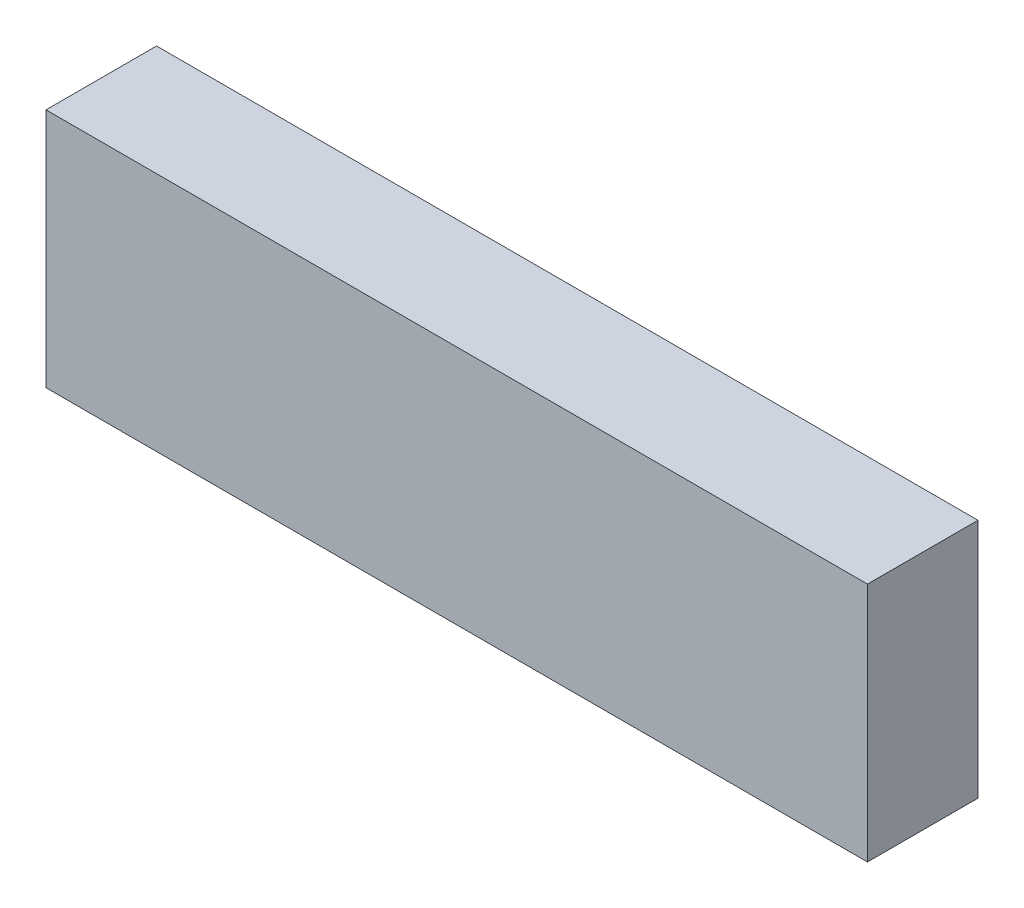
ISO-10303-21;
HEADER;
FILE_DESCRIPTION(('STEP AP214'),'2;1');
FILE_NAME('part.step','',(''),(''),'','','');
FILE_SCHEMA(('AUTOMOTIVE_DESIGN { 1 0 10303 214 1 1 1 1 }'));
ENDSEC;
DATA;
#1=APPLICATION_CONTEXT('core data for automotive mechanical design processes');
#2=APPLICATION_PROTOCOL_DEFINITION('international standard','automotive_design',2000,#1);
#3=PRODUCT_CONTEXT('',#1,'mechanical');
#4=PRODUCT('Part','Part','',(#3));
#5=PRODUCT_RELATED_PRODUCT_CATEGORY('part','',(#4));
#6=PRODUCT_DEFINITION_FORMATION('','',#4);
#7=PRODUCT_DEFINITION_CONTEXT('part definition',#1,'design');
#8=PRODUCT_DEFINITION('design','',#6,#7);
#9=PRODUCT_DEFINITION_SHAPE('','',#8);
#10=(LENGTH_UNIT() NAMED_UNIT(*) SI_UNIT(.MILLI.,.METRE.));
#11=(NAMED_UNIT(*) PLANE_ANGLE_UNIT() SI_UNIT($,.RADIAN.));
#12=(NAMED_UNIT(*) SI_UNIT($,.STERADIAN.) SOLID_ANGLE_UNIT());
#13=UNCERTAINTY_MEASURE_WITH_UNIT(LENGTH_MEASURE(1.E-05),#10,'distance_accuracy_value','');
#14=(GEOMETRIC_REPRESENTATION_CONTEXT(3) GLOBAL_UNCERTAINTY_ASSIGNED_CONTEXT((#13)) GLOBAL_UNIT_ASSIGNED_CONTEXT((#10,
#11,#12)) REPRESENTATION_CONTEXT('',''));
#15=CARTESIAN_POINT('',(0.,0.,0.));
#16=DIRECTION('',(0.,0.,1.));
#17=DIRECTION('',(1.,0.,0.));
#18=AXIS2_PLACEMENT_3D('',#15,#16,#17);
#19=CARTESIAN_POINT('',(29.58465,-8.66775,7.9629));
#20=DIRECTION('',(-1.,0.,0.));
#21=DIRECTION('',(0.,0.,1.));
#22=AXIS2_PLACEMENT_3D('',#19,#20,#21);
#23=PLANE('',#22);
#24=DIRECTION('',(0.,1.,0.));
#25=VECTOR('',#24,1.);
#26=CARTESIAN_POINT('',(29.58465,-8.66775,0.));
#27=LINE('',#26,#25);
#28=CARTESIAN_POINT('',(29.58465,-8.66775,0.));
#29=VERTEX_POINT('',#28);
#30=CARTESIAN_POINT('',(29.58465,8.66775,0.));
#31=VERTEX_POINT('',#30);
#32=EDGE_CURVE('E107',#29,#31,#27,.T.);
#33=ORIENTED_EDGE('',*,*,#32,.T.);
#34=DIRECTION('',(0.,0.,-1.));
#35=VECTOR('',#34,1.);
#36=CARTESIAN_POINT('',(29.58465,8.66775,7.9629));
#37=LINE('',#36,#35);
#38=CARTESIAN_POINT('',(29.58465,8.66775,7.9629));
#39=VERTEX_POINT('',#38);
#40=EDGE_CURVE('E11',#39,#31,#37,.T.);
#41=ORIENTED_EDGE('',*,*,#40,.F.);
#42=DIRECTION('',(0.,1.,0.));
#43=VECTOR('',#42,1.);
#44=CARTESIAN_POINT('',(29.58465,-8.66775,7.9629));
#45=LINE('',#44,#43);
#46=CARTESIAN_POINT('',(29.58465,-8.66775,7.9629));
#47=VERTEX_POINT('',#46);
#48=EDGE_CURVE('E91',#47,#39,#45,.T.);
#49=ORIENTED_EDGE('',*,*,#48,.F.);
#50=DIRECTION('',(0.,0.,-1.));
#51=VECTOR('',#50,1.);
#52=CARTESIAN_POINT('',(29.58465,-8.66775,7.9629));
#53=LINE('',#52,#51);
#54=EDGE_CURVE('E103',#47,#29,#53,.T.);
#55=ORIENTED_EDGE('',*,*,#54,.T.);
#56=EDGE_LOOP('',(#33,#41,#49,#55));
#57=FACE_BOUND('',#56,.T.);
#58=ADVANCED_FACE('F39',(#57),#23,.F.);
#59=CARTESIAN_POINT('',(-29.58465,8.66775,7.9629));
#60=DIRECTION('',(0.,-1.,0.));
#61=DIRECTION('',(0.,0.,-1.));
#62=AXIS2_PLACEMENT_3D('',#59,#60,#61);
#63=PLANE('',#62);
#64=DIRECTION('',(-1.,0.,0.));
#65=VECTOR('',#64,1.);
#66=CARTESIAN_POINT('',(-29.58465,8.66775,0.));
#67=LINE('',#66,#65);
#68=CARTESIAN_POINT('',(-29.58465,8.66775,0.));
#69=VERTEX_POINT('',#68);
#70=EDGE_CURVE('E96',#31,#69,#67,.T.);
#71=ORIENTED_EDGE('',*,*,#70,.T.);
#72=DIRECTION('',(0.,0.,-1.));
#73=VECTOR('',#72,1.);
#74=CARTESIAN_POINT('',(-29.58465,8.66775,7.9629));
#75=LINE('',#74,#73);
#76=CARTESIAN_POINT('',(-29.58465,8.66775,7.9629));
#77=VERTEX_POINT('',#76);
#78=EDGE_CURVE('E48',#77,#69,#75,.T.);
#79=ORIENTED_EDGE('',*,*,#78,.F.);
#80=DIRECTION('',(-1.,0.,0.));
#81=VECTOR('',#80,1.);
#82=CARTESIAN_POINT('',(-29.58465,8.66775,7.9629));
#83=LINE('',#82,#81);
#84=EDGE_CURVE('E86',#39,#77,#83,.T.);
#85=ORIENTED_EDGE('',*,*,#84,.F.);
#86=ORIENTED_EDGE('',*,*,#40,.T.);
#87=EDGE_LOOP('',(#71,#79,#85,#86));
#88=FACE_BOUND('',#87,.T.);
#89=ADVANCED_FACE('F95',(#88),#63,.F.);
#90=CARTESIAN_POINT('',(-29.58465,-8.66775,7.9629));
#91=DIRECTION('',(1.,0.,0.));
#92=DIRECTION('',(0.,0.,-1.));
#93=AXIS2_PLACEMENT_3D('',#90,#91,#92);
#94=PLANE('',#93);
#95=DIRECTION('',(0.,-1.,0.));
#96=VECTOR('',#95,1.);
#97=CARTESIAN_POINT('',(-29.58465,-8.66775,0.));
#98=LINE('',#97,#96);
#99=CARTESIAN_POINT('',(-29.58465,-8.66775,0.));
#100=VERTEX_POINT('',#99);
#101=EDGE_CURVE('E73',#69,#100,#98,.T.);
#102=ORIENTED_EDGE('',*,*,#101,.T.);
#103=DIRECTION('',(0.,0.,-1.));
#104=VECTOR('',#103,1.);
#105=CARTESIAN_POINT('',(-29.58465,-8.66775,7.9629));
#106=LINE('',#105,#104);
#107=CARTESIAN_POINT('',(-29.58465,-8.66775,7.9629));
#108=VERTEX_POINT('',#107);
#109=EDGE_CURVE('E98',#108,#100,#106,.T.);
#110=ORIENTED_EDGE('',*,*,#109,.F.);
#111=DIRECTION('',(0.,-1.,0.));
#112=VECTOR('',#111,1.);
#113=CARTESIAN_POINT('',(-29.58465,-8.66775,7.9629));
#114=LINE('',#113,#112);
#115=EDGE_CURVE('E89',#77,#108,#114,.T.);
#116=ORIENTED_EDGE('',*,*,#115,.F.);
#117=ORIENTED_EDGE('',*,*,#78,.T.);
#118=EDGE_LOOP('',(#102,#110,#116,#117));
#119=FACE_BOUND('',#118,.T.);
#120=ADVANCED_FACE('F99',(#119),#94,.F.);
#121=CARTESIAN_POINT('',(-29.58465,-8.66775,7.9629));
#122=DIRECTION('',(0.,1.,0.));
#123=DIRECTION('',(0.,0.,1.));
#124=AXIS2_PLACEMENT_3D('',#121,#122,#123);
#125=PLANE('',#124);
#126=DIRECTION('',(1.,0.,0.));
#127=VECTOR('',#126,1.);
#128=CARTESIAN_POINT('',(-29.58465,-8.66775,0.));
#129=LINE('',#128,#127);
#130=EDGE_CURVE('E79',#100,#29,#129,.T.);
#131=ORIENTED_EDGE('',*,*,#130,.T.);
#132=ORIENTED_EDGE('',*,*,#54,.F.);
#133=DIRECTION('',(1.,0.,0.));
#134=VECTOR('',#133,1.);
#135=CARTESIAN_POINT('',(-29.58465,-8.66775,7.9629));
#136=LINE('',#135,#134);
#137=EDGE_CURVE('E56',#108,#47,#136,.T.);
#138=ORIENTED_EDGE('',*,*,#137,.F.);
#139=ORIENTED_EDGE('',*,*,#109,.T.);
#140=EDGE_LOOP('',(#131,#132,#138,#139));
#141=FACE_BOUND('',#140,.T.);
#142=ADVANCED_FACE('F120',(#141),#125,.F.);
#143=CARTESIAN_POINT('',(0.,0.,7.9629));
#144=DIRECTION('',(0.,0.,-1.));
#145=DIRECTION('',(-1.,0.,0.));
#146=AXIS2_PLACEMENT_3D('',#143,#144,#145);
#147=PLANE('',#146);
#148=ORIENTED_EDGE('',*,*,#48,.T.);
#149=ORIENTED_EDGE('',*,*,#84,.T.);
#150=ORIENTED_EDGE('',*,*,#115,.T.);
#151=ORIENTED_EDGE('',*,*,#137,.T.);
#152=EDGE_LOOP('',(#148,#149,#150,#151));
#153=FACE_BOUND('',#152,.T.);
#154=ADVANCED_FACE('F87',(#153),#147,.F.);
#155=CARTESIAN_POINT('',(0.,0.,0.));
#156=DIRECTION('',(0.,0.,-1.));
#157=DIRECTION('',(-1.,0.,0.));
#158=AXIS2_PLACEMENT_3D('',#155,#156,#157);
#159=PLANE('',#158);
#160=ORIENTED_EDGE('',*,*,#32,.F.);
#161=ORIENTED_EDGE('',*,*,#130,.F.);
#162=ORIENTED_EDGE('',*,*,#101,.F.);
#163=ORIENTED_EDGE('',*,*,#70,.F.);
#164=EDGE_LOOP('',(#160,#161,#162,#163));
#165=FACE_BOUND('',#164,.T.);
#166=ADVANCED_FACE('F123',(#165),#159,.T.);
#167=CLOSED_SHELL('',(#58,#89,#120,#142,#154,#166));
#168=MANIFOLD_SOLID_BREP('B2',#167);
#169=ADVANCED_BREP_SHAPE_REPRESENTATION('',(#18,#168),#14);
#170=SHAPE_DEFINITION_REPRESENTATION(#9,#169);
ENDSEC;
END-ISO-10303-21;
